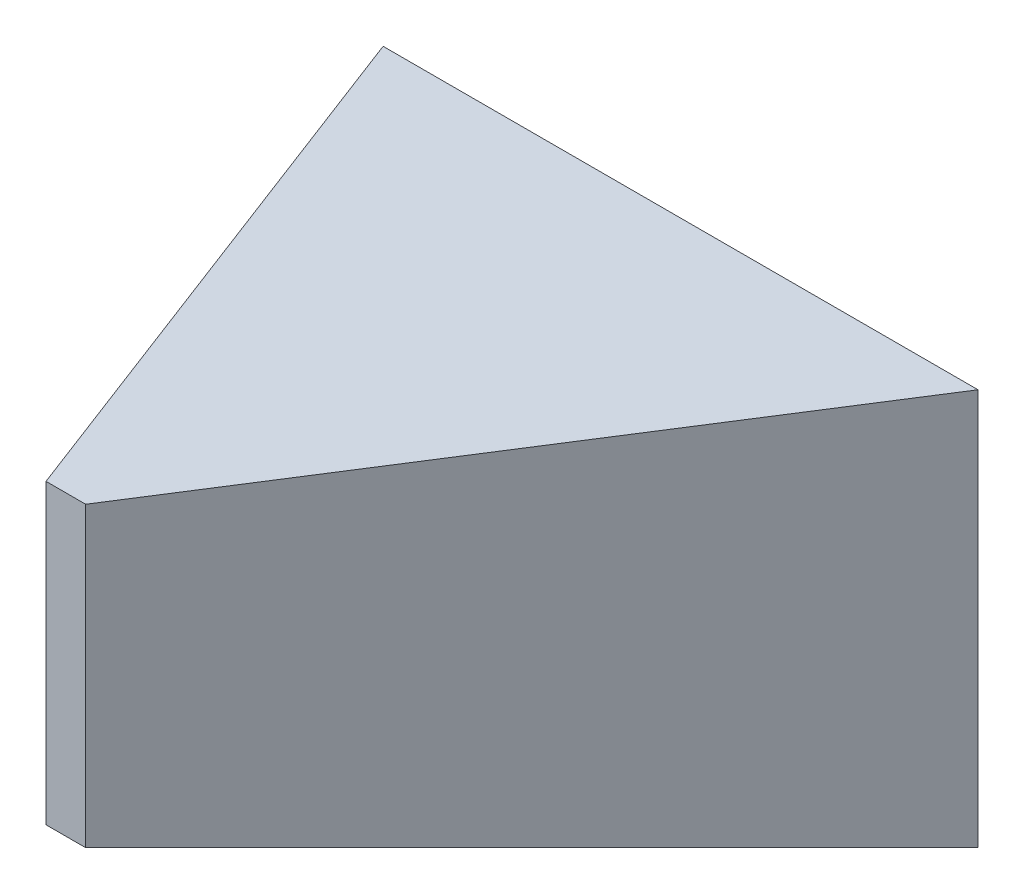
ISO-10303-21;
HEADER;
FILE_DESCRIPTION(('STEP AP214'),'2;1');
FILE_NAME('part.step','',(''),(''),'','','');
FILE_SCHEMA(('AUTOMOTIVE_DESIGN { 1 0 10303 214 1 1 1 1 }'));
ENDSEC;
DATA;
#1=APPLICATION_CONTEXT('core data for automotive mechanical design processes');
#2=APPLICATION_PROTOCOL_DEFINITION('international standard','automotive_design',2000,#1);
#3=PRODUCT_CONTEXT('',#1,'mechanical');
#4=PRODUCT('Part','Part','',(#3));
#5=PRODUCT_RELATED_PRODUCT_CATEGORY('part','',(#4));
#6=PRODUCT_DEFINITION_FORMATION('','',#4);
#7=PRODUCT_DEFINITION_CONTEXT('part definition',#1,'design');
#8=PRODUCT_DEFINITION('design','',#6,#7);
#9=PRODUCT_DEFINITION_SHAPE('','',#8);
#10=(LENGTH_UNIT() NAMED_UNIT(*) SI_UNIT(.MILLI.,.METRE.));
#11=(NAMED_UNIT(*) PLANE_ANGLE_UNIT() SI_UNIT($,.RADIAN.));
#12=(NAMED_UNIT(*) SI_UNIT($,.STERADIAN.) SOLID_ANGLE_UNIT());
#13=UNCERTAINTY_MEASURE_WITH_UNIT(LENGTH_MEASURE(1.E-05),#10,'distance_accuracy_value','');
#14=(GEOMETRIC_REPRESENTATION_CONTEXT(3) GLOBAL_UNCERTAINTY_ASSIGNED_CONTEXT((#13)) GLOBAL_UNIT_ASSIGNED_CONTEXT((#10,
#11,#12)) REPRESENTATION_CONTEXT('',''));
#15=CARTESIAN_POINT('',(0.,0.,0.));
#16=DIRECTION('',(0.,0.,1.));
#17=DIRECTION('',(1.,0.,0.));
#18=AXIS2_PLACEMENT_3D('',#15,#16,#17);
#19=CARTESIAN_POINT('',(0.,0.,0.));
#20=DIRECTION('',(0.,0.,-1.));
#21=DIRECTION('',(-1.,0.,0.));
#22=AXIS2_PLACEMENT_3D('',#19,#20,#21);
#23=PLANE('',#22);
#24=DIRECTION('',(0.,-1.,0.));
#25=VECTOR('',#24,1.);
#26=CARTESIAN_POINT('',(0.,0.,0.));
#27=LINE('',#26,#25);
#28=CARTESIAN_POINT('',(0.,20.,0.));
#29=VERTEX_POINT('',#28);
#30=CARTESIAN_POINT('',(0.,0.,0.));
#31=VERTEX_POINT('',#30);
#32=EDGE_CURVE('E185',#29,#31,#27,.T.);
#33=ORIENTED_EDGE('',*,*,#32,.F.);
#34=DIRECTION('',(-1.,0.,0.));
#35=VECTOR('',#34,1.);
#36=CARTESIAN_POINT('',(0.,20.,0.));
#37=LINE('',#36,#35);
#38=CARTESIAN_POINT('',(30.,20.,0.));
#39=VERTEX_POINT('',#38);
#40=EDGE_CURVE('E95',#39,#29,#37,.T.);
#41=ORIENTED_EDGE('',*,*,#40,.F.);
#42=DIRECTION('',(0.,1.,0.));
#43=VECTOR('',#42,1.);
#44=CARTESIAN_POINT('',(30.,0.,0.));
#45=LINE('',#44,#43);
#46=CARTESIAN_POINT('',(30.,0.,0.));
#47=VERTEX_POINT('',#46);
#48=EDGE_CURVE('E53',#47,#39,#45,.T.);
#49=ORIENTED_EDGE('',*,*,#48,.F.);
#50=DIRECTION('',(1.,0.,0.));
#51=VECTOR('',#50,1.);
#52=CARTESIAN_POINT('',(0.,0.,0.));
#53=LINE('',#52,#51);
#54=EDGE_CURVE('E12',#31,#47,#53,.T.);
#55=ORIENTED_EDGE('',*,*,#54,.F.);
#56=EDGE_LOOP('',(#33,#41,#49,#55));
#57=FACE_BOUND('',#56,.T.);
#58=ADVANCED_FACE('F43',(#57),#23,.T.);
#59=CARTESIAN_POINT('',(0.,0.,25.));
#60=DIRECTION('',(0.,0.,-1.));
#61=DIRECTION('',(-1.,0.,0.));
#62=AXIS2_PLACEMENT_3D('',#59,#60,#61);
#63=PLANE('',#62);
#64=DIRECTION('',(1.,0.,0.));
#65=VECTOR('',#64,1.);
#66=CARTESIAN_POINT('',(8.,2.5,25.));
#67=LINE('',#66,#65);
#68=CARTESIAN_POINT('',(8.,2.5,25.));
#69=VERTEX_POINT('',#68);
#70=CARTESIAN_POINT('',(10.,2.5,25.));
#71=VERTEX_POINT('',#70);
#72=EDGE_CURVE('E154',#69,#71,#67,.T.);
#73=ORIENTED_EDGE('',*,*,#72,.T.);
#74=DIRECTION('',(0.,-1.,0.));
#75=VECTOR('',#74,1.);
#76=CARTESIAN_POINT('',(10.,17.5,25.));
#77=LINE('',#76,#75);
#78=CARTESIAN_POINT('',(10.,17.5,25.));
#79=VERTEX_POINT('',#78);
#80=EDGE_CURVE('E115',#79,#71,#77,.T.);
#81=ORIENTED_EDGE('',*,*,#80,.F.);
#82=DIRECTION('',(1.,0.,0.));
#83=VECTOR('',#82,1.);
#84=CARTESIAN_POINT('',(8.,17.5,25.));
#85=LINE('',#84,#83);
#86=CARTESIAN_POINT('',(8.,17.5,25.));
#87=VERTEX_POINT('',#86);
#88=EDGE_CURVE('E91',#87,#79,#85,.T.);
#89=ORIENTED_EDGE('',*,*,#88,.F.);
#90=DIRECTION('',(0.,-1.,0.));
#91=VECTOR('',#90,1.);
#92=CARTESIAN_POINT('',(8.,17.5,25.));
#93=LINE('',#92,#91);
#94=EDGE_CURVE('E101',#87,#69,#93,.T.);
#95=ORIENTED_EDGE('',*,*,#94,.T.);
#96=EDGE_LOOP('',(#73,#81,#89,#95));
#97=FACE_BOUND('',#96,.T.);
#98=ADVANCED_FACE('F114',(#97),#63,.F.);
#99=CARTESIAN_POINT('',(0.,19.8019801980198,1.98019801980198));
#100=DIRECTION('',(0.,0.995037190209989,0.099503719020999));
#101=DIRECTION('',(0.,-0.099503719020999,0.995037190209989));
#102=AXIS2_PLACEMENT_3D('',#99,#100,#101);
#103=PLANE('',#102);
#104=DIRECTION('',(0.622799155329218,0.0778498944161524,-0.778498944161523));
#105=VECTOR('',#104,1.);
#106=CARTESIAN_POINT('',(10.,17.5,25.));
#107=LINE('',#106,#105);
#108=EDGE_CURVE('E98',#79,#39,#107,.T.);
#109=ORIENTED_EDGE('',*,*,#108,.T.);
#110=ORIENTED_EDGE('',*,*,#40,.T.);
#111=DIRECTION('',(-0.303402732793906,0.0948133539980958,-0.948133539980957));
#112=VECTOR('',#111,1.);
#113=CARTESIAN_POINT('',(8.,17.5,25.));
#114=LINE('',#113,#112);
#115=EDGE_CURVE('E86',#87,#29,#114,.T.);
#116=ORIENTED_EDGE('',*,*,#115,.F.);
#117=ORIENTED_EDGE('',*,*,#88,.T.);
#118=EDGE_LOOP('',(#109,#110,#116,#117));
#119=FACE_BOUND('',#118,.T.);
#120=ADVANCED_FACE('F89',(#119),#103,.T.);
#121=CARTESIAN_POINT('',(0.,0.,0.));
#122=DIRECTION('',(-0.952424147199324,0.,0.304775727103784));
#123=DIRECTION('',(0.304775727103784,0.,0.952424147199324));
#124=AXIS2_PLACEMENT_3D('',#121,#122,#123);
#125=PLANE('',#124);
#126=ORIENTED_EDGE('',*,*,#115,.T.);
#127=ORIENTED_EDGE('',*,*,#32,.T.);
#128=DIRECTION('',(-0.303402732793906,-0.0948133539980957,-0.948133539980957));
#129=VECTOR('',#128,1.);
#130=CARTESIAN_POINT('',(8.,2.5,25.));
#131=LINE('',#130,#129);
#132=EDGE_CURVE('E105',#69,#31,#131,.T.);
#133=ORIENTED_EDGE('',*,*,#132,.F.);
#134=ORIENTED_EDGE('',*,*,#94,.F.);
#135=EDGE_LOOP('',(#126,#127,#133,#134));
#136=FACE_BOUND('',#135,.T.);
#137=ADVANCED_FACE('F103',(#136),#125,.T.);
#138=CARTESIAN_POINT('',(18.2926829268293,0.,14.6341463414634));
#139=DIRECTION('',(0.78086880944303,0.,0.624695047554424));
#140=DIRECTION('',(0.624695047554424,0.,-0.78086880944303));
#141=AXIS2_PLACEMENT_3D('',#138,#139,#140);
#142=PLANE('',#141);
#143=DIRECTION('',(0.622799155329218,-0.0778498944161523,-0.778498944161523));
#144=VECTOR('',#143,1.);
#145=CARTESIAN_POINT('',(10.,2.5,25.));
#146=LINE('',#145,#144);
#147=EDGE_CURVE('E61',#71,#47,#146,.T.);
#148=ORIENTED_EDGE('',*,*,#147,.T.);
#149=ORIENTED_EDGE('',*,*,#48,.T.);
#150=ORIENTED_EDGE('',*,*,#108,.F.);
#151=ORIENTED_EDGE('',*,*,#80,.T.);
#152=EDGE_LOOP('',(#148,#149,#150,#151));
#153=FACE_BOUND('',#152,.T.);
#154=ADVANCED_FACE('F221',(#153),#142,.T.);
#155=CARTESIAN_POINT('',(0.,0.,0.));
#156=DIRECTION('',(0.,-0.995037190209989,0.0995037190209989));
#157=DIRECTION('',(0.,-0.0995037190209989,-0.995037190209989));
#158=AXIS2_PLACEMENT_3D('',#155,#156,#157);
#159=PLANE('',#158);
#160=ORIENTED_EDGE('',*,*,#132,.T.);
#161=ORIENTED_EDGE('',*,*,#54,.T.);
#162=ORIENTED_EDGE('',*,*,#147,.F.);
#163=ORIENTED_EDGE('',*,*,#72,.F.);
#164=EDGE_LOOP('',(#160,#161,#162,#163));
#165=FACE_BOUND('',#164,.T.);
#166=ADVANCED_FACE('F229',(#165),#159,.T.);
#167=CLOSED_SHELL('',(#58,#98,#120,#137,#154,#166));
#168=MANIFOLD_SOLID_BREP('B2',#167);
#169=ADVANCED_BREP_SHAPE_REPRESENTATION('',(#18,#168),#14);
#170=SHAPE_DEFINITION_REPRESENTATION(#9,#169);
ENDSEC;
END-ISO-10303-21;
